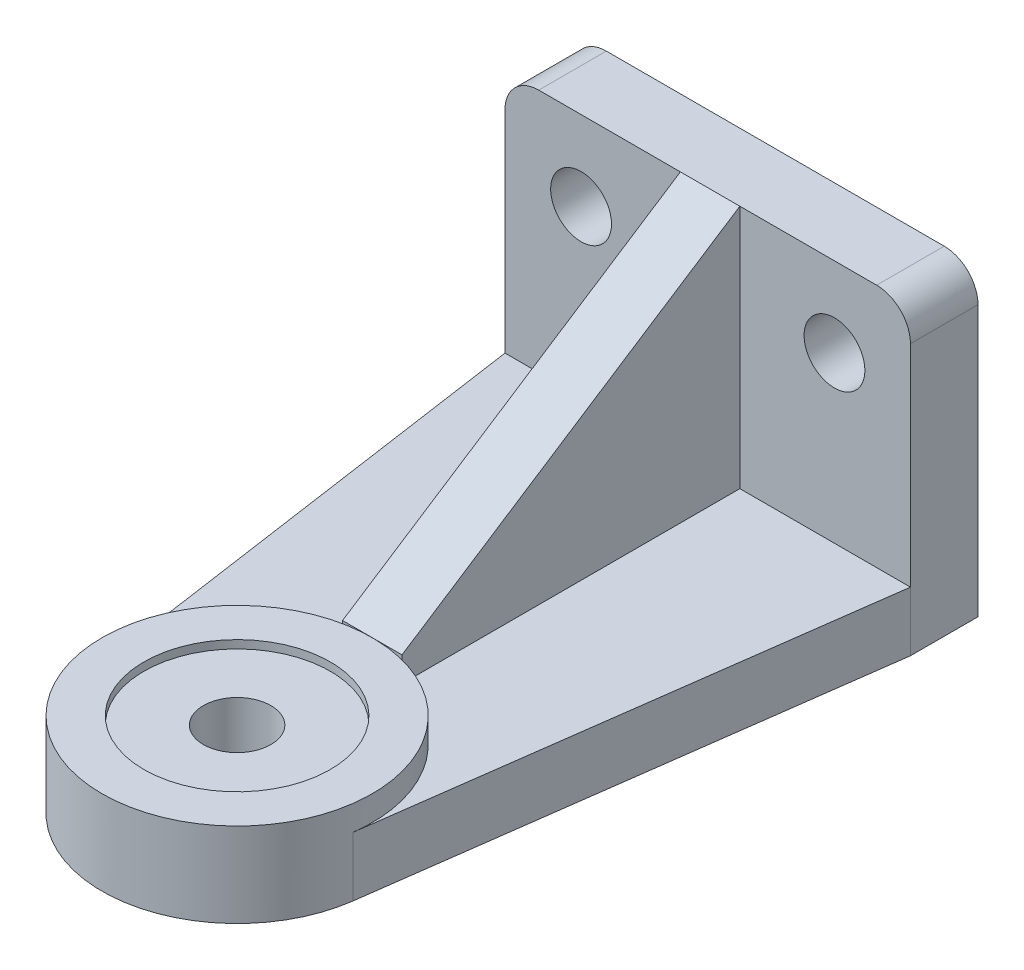
ISO-10303-21;
HEADER;
FILE_DESCRIPTION(('STEP AP214'),'2;1');
FILE_NAME('part.step','',(''),(''),'','','');
FILE_SCHEMA(('AUTOMOTIVE_DESIGN { 1 0 10303 214 1 1 1 1 }'));
ENDSEC;
DATA;
#1=APPLICATION_CONTEXT('core data for automotive mechanical design processes');
#2=APPLICATION_PROTOCOL_DEFINITION('international standard','automotive_design',2000,#1);
#3=PRODUCT_CONTEXT('',#1,'mechanical');
#4=PRODUCT('Part','Part','',(#3));
#5=PRODUCT_RELATED_PRODUCT_CATEGORY('part','',(#4));
#6=PRODUCT_DEFINITION_FORMATION('','',#4);
#7=PRODUCT_DEFINITION_CONTEXT('part definition',#1,'design');
#8=PRODUCT_DEFINITION('design','',#6,#7);
#9=PRODUCT_DEFINITION_SHAPE('','',#8);
#10=(LENGTH_UNIT() NAMED_UNIT(*) SI_UNIT(.MILLI.,.METRE.));
#11=(NAMED_UNIT(*) PLANE_ANGLE_UNIT() SI_UNIT($,.RADIAN.));
#12=(NAMED_UNIT(*) SI_UNIT($,.STERADIAN.) SOLID_ANGLE_UNIT());
#13=UNCERTAINTY_MEASURE_WITH_UNIT(LENGTH_MEASURE(1.E-05),#10,'distance_accuracy_value','');
#14=(GEOMETRIC_REPRESENTATION_CONTEXT(3) GLOBAL_UNCERTAINTY_ASSIGNED_CONTEXT((#13)) GLOBAL_UNIT_ASSIGNED_CONTEXT((#10,
#11,#12)) REPRESENTATION_CONTEXT('',''));
#15=CARTESIAN_POINT('',(0.,0.,0.));
#16=DIRECTION('',(0.,0.,1.));
#17=DIRECTION('',(1.,0.,0.));
#18=AXIS2_PLACEMENT_3D('',#15,#16,#17);
#19=CARTESIAN_POINT('',(5.588,11.176,-88.9));
#20=DIRECTION('',(0.,0.,1.));
#21=DIRECTION('',(1.,0.,0.));
#22=AXIS2_PLACEMENT_3D('',#19,#20,#21);
#23=PLANE('',#22);
#24=DIRECTION('',(0.,1.,0.));
#25=VECTOR('',#24,1.);
#26=CARTESIAN_POINT('',(-5.588,11.176,-88.9));
#27=LINE('',#26,#25);
#28=CARTESIAN_POINT('',(-5.588,11.176,-88.9));
#29=VERTEX_POINT('',#28);
#30=CARTESIAN_POINT('',(-5.588,57.15,-88.9));
#31=VERTEX_POINT('',#30);
#32=EDGE_CURVE('E117',#29,#31,#27,.T.);
#33=ORIENTED_EDGE('',*,*,#32,.T.);
#34=DIRECTION('',(-1.,0.,0.));
#35=VECTOR('',#34,1.);
#36=CARTESIAN_POINT('',(5.588,57.15,-88.9));
#37=LINE('',#36,#35);
#38=CARTESIAN_POINT('',(5.588,57.15,-88.9));
#39=VERTEX_POINT('',#38);
#40=EDGE_CURVE('E12',#39,#31,#37,.T.);
#41=ORIENTED_EDGE('',*,*,#40,.F.);
#42=DIRECTION('',(0.,1.,0.));
#43=VECTOR('',#42,1.);
#44=CARTESIAN_POINT('',(5.588,11.176,-88.9));
#45=LINE('',#44,#43);
#46=CARTESIAN_POINT('',(5.588,11.176,-88.9));
#47=VERTEX_POINT('',#46);
#48=EDGE_CURVE('E100',#47,#39,#45,.T.);
#49=ORIENTED_EDGE('',*,*,#48,.F.);
#50=DIRECTION('',(-1.,0.,0.));
#51=VECTOR('',#50,1.);
#52=CARTESIAN_POINT('',(5.588,11.176,-88.9));
#53=LINE('',#52,#51);
#54=EDGE_CURVE('E113',#47,#29,#53,.T.);
#55=ORIENTED_EDGE('',*,*,#54,.T.);
#56=EDGE_LOOP('',(#33,#41,#49,#55));
#57=FACE_BOUND('',#56,.T.);
#58=ADVANCED_FACE('F48',(#57),#23,.F.);
#59=CARTESIAN_POINT('',(5.588,57.15,-88.9));
#60=DIRECTION('',(0.,-0.838443616300637,-0.544988350595414));
#61=DIRECTION('',(0.,0.544988350595414,-0.838443616300637));
#62=AXIS2_PLACEMENT_3D('',#59,#60,#61);
#63=PLANE('',#62);
#64=DIRECTION('',(0.,-0.544988350595414,0.838443616300637));
#65=VECTOR('',#64,1.);
#66=CARTESIAN_POINT('',(-5.588,57.15,-88.9));
#67=LINE('',#66,#65);
#68=CARTESIAN_POINT('',(-5.588,15.875,-25.4));
#69=VERTEX_POINT('',#68);
#70=EDGE_CURVE('E105',#31,#69,#67,.T.);
#71=ORIENTED_EDGE('',*,*,#70,.T.);
#72=DIRECTION('',(-1.,0.,0.));
#73=VECTOR('',#72,1.);
#74=CARTESIAN_POINT('',(5.588,15.875,-25.4));
#75=LINE('',#74,#73);
#76=CARTESIAN_POINT('',(5.588,15.875,-25.4));
#77=VERTEX_POINT('',#76);
#78=EDGE_CURVE('E57',#77,#69,#75,.T.);
#79=ORIENTED_EDGE('',*,*,#78,.F.);
#80=DIRECTION('',(0.,-0.544988350595414,0.838443616300637));
#81=VECTOR('',#80,1.);
#82=CARTESIAN_POINT('',(5.588,57.15,-88.9));
#83=LINE('',#82,#81);
#84=EDGE_CURVE('E95',#39,#77,#83,.T.);
#85=ORIENTED_EDGE('',*,*,#84,.F.);
#86=ORIENTED_EDGE('',*,*,#40,.T.);
#87=EDGE_LOOP('',(#71,#79,#85,#86));
#88=FACE_BOUND('',#87,.T.);
#89=ADVANCED_FACE('F104',(#88),#63,.F.);
#90=CARTESIAN_POINT('',(5.588,15.875,-25.4));
#91=DIRECTION('',(0.,0.,-1.));
#92=DIRECTION('',(-1.,0.,0.));
#93=AXIS2_PLACEMENT_3D('',#90,#91,#92);
#94=PLANE('',#93);
#95=DIRECTION('',(0.,-1.,0.));
#96=VECTOR('',#95,1.);
#97=CARTESIAN_POINT('',(-5.588,15.875,-25.4));
#98=LINE('',#97,#96);
#99=CARTESIAN_POINT('',(-5.588,11.176,-25.4));
#100=VERTEX_POINT('',#99);
#101=EDGE_CURVE('E82',#69,#100,#98,.T.);
#102=ORIENTED_EDGE('',*,*,#101,.T.);
#103=DIRECTION('',(-1.,0.,0.));
#104=VECTOR('',#103,1.);
#105=CARTESIAN_POINT('',(5.588,11.176,-25.4));
#106=LINE('',#105,#104);
#107=CARTESIAN_POINT('',(5.588,11.176,-25.4));
#108=VERTEX_POINT('',#107);
#109=EDGE_CURVE('E107',#108,#100,#106,.T.);
#110=ORIENTED_EDGE('',*,*,#109,.F.);
#111=DIRECTION('',(0.,-1.,0.));
#112=VECTOR('',#111,1.);
#113=CARTESIAN_POINT('',(5.588,15.875,-25.4));
#114=LINE('',#113,#112);
#115=EDGE_CURVE('E98',#77,#108,#114,.T.);
#116=ORIENTED_EDGE('',*,*,#115,.F.);
#117=ORIENTED_EDGE('',*,*,#78,.T.);
#118=EDGE_LOOP('',(#102,#110,#116,#117));
#119=FACE_BOUND('',#118,.T.);
#120=ADVANCED_FACE('F108',(#119),#94,.F.);
#121=CARTESIAN_POINT('',(5.588,11.176,-25.4));
#122=DIRECTION('',(0.,1.,0.));
#123=DIRECTION('',(0.,0.,1.));
#124=AXIS2_PLACEMENT_3D('',#121,#122,#123);
#125=PLANE('',#124);
#126=DIRECTION('',(0.,0.,-1.));
#127=VECTOR('',#126,1.);
#128=CARTESIAN_POINT('',(-5.588,11.176,-25.4));
#129=LINE('',#128,#127);
#130=EDGE_CURVE('E88',#100,#29,#129,.T.);
#131=ORIENTED_EDGE('',*,*,#130,.T.);
#132=ORIENTED_EDGE('',*,*,#54,.F.);
#133=DIRECTION('',(0.,0.,-1.));
#134=VECTOR('',#133,1.);
#135=CARTESIAN_POINT('',(5.588,11.176,-25.4));
#136=LINE('',#135,#134);
#137=EDGE_CURVE('E65',#108,#47,#136,.T.);
#138=ORIENTED_EDGE('',*,*,#137,.F.);
#139=ORIENTED_EDGE('',*,*,#109,.T.);
#140=EDGE_LOOP('',(#131,#132,#138,#139));
#141=FACE_BOUND('',#140,.T.);
#142=ADVANCED_FACE('F131',(#141),#125,.F.);
#143=CARTESIAN_POINT('',(5.588,0.,0.));
#144=DIRECTION('',(-1.,0.,0.));
#145=DIRECTION('',(0.,0.,1.));
#146=AXIS2_PLACEMENT_3D('',#143,#144,#145);
#147=PLANE('',#146);
#148=ORIENTED_EDGE('',*,*,#48,.T.);
#149=ORIENTED_EDGE('',*,*,#84,.T.);
#150=ORIENTED_EDGE('',*,*,#115,.T.);
#151=ORIENTED_EDGE('',*,*,#137,.T.);
#152=EDGE_LOOP('',(#148,#149,#150,#151));
#153=FACE_BOUND('',#152,.T.);
#154=ADVANCED_FACE('F96',(#153),#147,.F.);
#155=CARTESIAN_POINT('',(-5.588,0.,0.));
#156=DIRECTION('',(-1.,0.,0.));
#157=DIRECTION('',(0.,0.,1.));
#158=AXIS2_PLACEMENT_3D('',#155,#156,#157);
#159=PLANE('',#158);
#160=ORIENTED_EDGE('',*,*,#32,.F.);
#161=ORIENTED_EDGE('',*,*,#130,.F.);
#162=ORIENTED_EDGE('',*,*,#101,.F.);
#163=ORIENTED_EDGE('',*,*,#70,.F.);
#164=EDGE_LOOP('',(#160,#161,#162,#163));
#165=FACE_BOUND('',#164,.T.);
#166=ADVANCED_FACE('F134',(#165),#159,.T.);
#167=CLOSED_SHELL('',(#58,#89,#120,#142,#154,#166));
#168=MANIFOLD_SOLID_BREP('B2',#167);
#169=CARTESIAN_POINT('',(37.6477006881978,15.875,-88.9));
#170=DIRECTION('',(-0.990987706001351,0.,-0.133952851982256));
#171=DIRECTION('',(-0.133952851982256,0.,0.990987706001351));
#172=AXIS2_PLACEMENT_3D('',#169,#170,#171);
#173=PLANE('',#172);
#174=DIRECTION('',(0.133952851982256,0.,-0.990987706001351));
#175=VECTOR('',#174,1.);
#176=CARTESIAN_POINT('',(37.6477006881978,11.176,-88.9));
#177=LINE('',#176,#175);
#178=CARTESIAN_POINT('',(25.1710877324343,11.176,3.40240244034931));
#179=VERTEX_POINT('',#178);
#180=CARTESIAN_POINT('',(37.6477006881978,11.176,-88.9));
#181=VERTEX_POINT('',#180);
#182=EDGE_CURVE('E323',#179,#181,#177,.T.);
#183=ORIENTED_EDGE('',*,*,#182,.F.);
#184=DIRECTION('',(0.,-1.,0.));
#185=VECTOR('',#184,1.);
#186=CARTESIAN_POINT('',(25.1710877324343,15.875,3.40240244034931));
#187=LINE('',#186,#185);
#188=CARTESIAN_POINT('',(25.1710877324343,0.,3.40240244034931));
#189=VERTEX_POINT('',#188);
#190=EDGE_CURVE('E355',#179,#189,#187,.T.);
#191=ORIENTED_EDGE('',*,*,#190,.T.);
#192=DIRECTION('',(0.133952851982256,0.,-0.990987706001351));
#193=VECTOR('',#192,1.);
#194=CARTESIAN_POINT('',(37.6477006881978,0.,-88.9));
#195=LINE('',#194,#193);
#196=CARTESIAN_POINT('',(37.6477006881978,0.,-88.9));
#197=VERTEX_POINT('',#196);
#198=EDGE_CURVE('E341',#189,#197,#195,.T.);
#199=ORIENTED_EDGE('',*,*,#198,.T.);
#200=DIRECTION('',(0.,-1.,0.));
#201=VECTOR('',#200,1.);
#202=CARTESIAN_POINT('',(37.6477006881978,15.875,-88.9));
#203=LINE('',#202,#201);
#204=EDGE_CURVE('E307',#181,#197,#203,.T.);
#205=ORIENTED_EDGE('',*,*,#204,.F.);
#206=EDGE_LOOP('',(#183,#191,#199,#205));
#207=FACE_BOUND('',#206,.T.);
#208=ADVANCED_FACE('F207',(#207),#173,.F.);
#209=CARTESIAN_POINT('',(-25.137268282347,15.875,3.64386378742537));
#210=DIRECTION('',(0.989656231588466,0.,-0.143459204229346));
#211=DIRECTION('',(-0.143459204229346,0.,-0.989656231588466));
#212=AXIS2_PLACEMENT_3D('',#209,#210,#211);
#213=PLANE('',#212);
#214=DIRECTION('',(0.143459204229346,0.,0.989656231588466));
#215=VECTOR('',#214,1.);
#216=CARTESIAN_POINT('',(-25.137268282347,11.176,3.64386378742537));
#217=LINE('',#216,#215);
#218=CARTESIAN_POINT('',(-38.5522993118022,11.176,-88.9));
#219=VERTEX_POINT('',#218);
#220=CARTESIAN_POINT('',(-25.137268282347,11.176,3.64386378742535));
#221=VERTEX_POINT('',#220);
#222=EDGE_CURVE('E309',#219,#221,#217,.T.);
#223=ORIENTED_EDGE('',*,*,#222,.F.);
#224=DIRECTION('',(0.,-1.,0.));
#225=VECTOR('',#224,1.);
#226=CARTESIAN_POINT('',(-38.5522993118022,15.875,-88.9));
#227=LINE('',#226,#225);
#228=CARTESIAN_POINT('',(-38.5522993118023,0.,-88.9));
#229=VERTEX_POINT('',#228);
#230=EDGE_CURVE('E349',#219,#229,#227,.T.);
#231=ORIENTED_EDGE('',*,*,#230,.T.);
#232=DIRECTION('',(0.143459204229346,0.,0.989656231588466));
#233=VECTOR('',#232,1.);
#234=CARTESIAN_POINT('',(-25.137268282347,0.,3.64386378742537));
#235=LINE('',#234,#233);
#236=CARTESIAN_POINT('',(-25.137268282347,0.,3.64386378742537));
#237=VERTEX_POINT('',#236);
#238=EDGE_CURVE('E337',#229,#237,#235,.T.);
#239=ORIENTED_EDGE('',*,*,#238,.T.);
#240=DIRECTION('',(0.,-1.,0.));
#241=VECTOR('',#240,1.);
#242=CARTESIAN_POINT('',(-25.137268282347,15.875,3.64386378742537));
#243=LINE('',#242,#241);
#244=EDGE_CURVE('E336',#221,#237,#243,.T.);
#245=ORIENTED_EDGE('',*,*,#244,.F.);
#246=EDGE_LOOP('',(#223,#231,#239,#245));
#247=FACE_BOUND('',#246,.T.);
#248=ADVANCED_FACE('F479',(#247),#213,.F.);
#249=CARTESIAN_POINT('',(0.,15.875,0.));
#250=DIRECTION('',(0.,1.,0.));
#251=DIRECTION('',(0.,0.,1.));
#252=AXIS2_PLACEMENT_3D('',#249,#250,#251);
#253=PLANE('',#252);
#254=CARTESIAN_POINT('',(0.,15.875,0.));
#255=DIRECTION('',(0.,1.,0.));
#256=DIRECTION('',(0.,0.,1.));
#257=AXIS2_PLACEMENT_3D('',#254,#255,#256);
#258=CIRCLE('',#257,17.526);
#259=CARTESIAN_POINT('',(0.,15.875,17.526));
#260=VERTEX_POINT('',#259);
#261=EDGE_CURVE('E432',#260,#260,#258,.T.);
#262=ORIENTED_EDGE('',*,*,#261,.F.);
#263=EDGE_LOOP('',(#262));
#264=FACE_BOUND('',#263,.T.);
#265=CARTESIAN_POINT('',(0.,15.875,0.));
#266=DIRECTION('',(0.,1.,0.));
#267=DIRECTION('',(0.,0.,1.));
#268=AXIS2_PLACEMENT_3D('',#265,#266,#267);
#269=CIRCLE('',#268,25.4);
#270=CARTESIAN_POINT('',(0.,15.875,25.4));
#271=VERTEX_POINT('',#270);
#272=EDGE_CURVE('E332',#271,#271,#269,.T.);
#273=ORIENTED_EDGE('',*,*,#272,.T.);
#274=EDGE_LOOP('',(#273));
#275=FACE_BOUND('',#274,.T.);
#276=ADVANCED_FACE('F485',(#264,#275),#253,.T.);
#277=CARTESIAN_POINT('',(0.,15.875,0.));
#278=DIRECTION('',(0.,-1.,0.));
#279=DIRECTION('',(0.,0.,-1.));
#280=AXIS2_PLACEMENT_3D('',#277,#278,#279);
#281=CYLINDRICAL_SURFACE('',#280,25.4);
#282=ORIENTED_EDGE('',*,*,#190,.F.);
#283=CARTESIAN_POINT('',(0.,11.176,0.));
#284=DIRECTION('',(0.,-1.,0.));
#285=DIRECTION('',(0.,0.,1.));
#286=AXIS2_PLACEMENT_3D('',#283,#284,#285);
#287=CIRCLE('',#286,25.4);
#288=EDGE_CURVE('E315',#221,#179,#287,.T.);
#289=ORIENTED_EDGE('',*,*,#288,.F.);
#290=ORIENTED_EDGE('',*,*,#244,.T.);
#291=CARTESIAN_POINT('',(0.,0.,0.));
#292=DIRECTION('',(0.,1.,0.));
#293=DIRECTION('',(0.,0.,1.));
#294=AXIS2_PLACEMENT_3D('',#291,#292,#293);
#295=CIRCLE('',#294,25.4);
#296=EDGE_CURVE('E331',#237,#189,#295,.T.);
#297=ORIENTED_EDGE('',*,*,#296,.T.);
#298=EDGE_LOOP('',(#282,#289,#290,#297));
#299=FACE_BOUND('',#298,.T.);
#300=ORIENTED_EDGE('',*,*,#272,.F.);
#301=EDGE_LOOP('',(#300));
#302=FACE_BOUND('',#301,.T.);
#303=ADVANCED_FACE('F491',(#299,#302),#281,.T.);
#304=CARTESIAN_POINT('',(0.,0.,0.));
#305=DIRECTION('',(0.,1.,0.));
#306=DIRECTION('',(0.,0.,1.));
#307=AXIS2_PLACEMENT_3D('',#304,#305,#306);
#308=PLANE('',#307);
#309=CARTESIAN_POINT('',(0.,0.,0.));
#310=DIRECTION('',(0.,1.,0.));
#311=DIRECTION('',(0.,0.,1.));
#312=AXIS2_PLACEMENT_3D('',#309,#310,#311);
#313=CIRCLE('',#312,6.35);
#314=CARTESIAN_POINT('',(0.,0.,6.35));
#315=VERTEX_POINT('',#314);
#316=EDGE_CURVE('E416',#315,#315,#313,.T.);
#317=ORIENTED_EDGE('',*,*,#316,.T.);
#318=EDGE_LOOP('',(#317));
#319=FACE_BOUND('',#318,.T.);
#320=ORIENTED_EDGE('',*,*,#296,.F.);
#321=ORIENTED_EDGE('',*,*,#238,.F.);
#322=DIRECTION('',(0.,0.,1.));
#323=VECTOR('',#322,1.);
#324=CARTESIAN_POINT('',(-38.5522993118023,0.,-101.6));
#325=LINE('',#324,#323);
#326=CARTESIAN_POINT('',(-38.5522993118023,0.,-101.6));
#327=VERTEX_POINT('',#326);
#328=EDGE_CURVE('E301',#327,#229,#325,.T.);
#329=ORIENTED_EDGE('',*,*,#328,.F.);
#330=DIRECTION('',(-1.,0.,0.));
#331=VECTOR('',#330,1.);
#332=CARTESIAN_POINT('',(37.6477006881978,0.,-101.6));
#333=LINE('',#332,#331);
#334=CARTESIAN_POINT('',(37.6477006881978,0.,-101.6));
#335=VERTEX_POINT('',#334);
#336=EDGE_CURVE('E283',#335,#327,#333,.T.);
#337=ORIENTED_EDGE('',*,*,#336,.F.);
#338=DIRECTION('',(0.,0.,1.));
#339=VECTOR('',#338,1.);
#340=CARTESIAN_POINT('',(37.6477006881978,0.,-101.6));
#341=LINE('',#340,#339);
#342=EDGE_CURVE('E298',#335,#197,#341,.T.);
#343=ORIENTED_EDGE('',*,*,#342,.T.);
#344=ORIENTED_EDGE('',*,*,#198,.F.);
#345=EDGE_LOOP('',(#320,#321,#329,#337,#343,#344));
#346=FACE_BOUND('',#345,.T.);
#347=ADVANCED_FACE('F296',(#319,#346),#308,.F.);
#348=CARTESIAN_POINT('',(0.,11.176,0.));
#349=DIRECTION('',(0.,1.,0.));
#350=DIRECTION('',(0.,0.,1.));
#351=AXIS2_PLACEMENT_3D('',#348,#349,#350);
#352=PLANE('',#351);
#353=ORIENTED_EDGE('',*,*,#222,.T.);
#354=ORIENTED_EDGE('',*,*,#288,.T.);
#355=ORIENTED_EDGE('',*,*,#182,.T.);
#356=DIRECTION('',(-1.,0.,0.));
#357=VECTOR('',#356,1.);
#358=CARTESIAN_POINT('',(-38.5522993118022,11.176,-88.9));
#359=LINE('',#358,#357);
#360=EDGE_CURVE('E327',#181,#219,#359,.T.);
#361=ORIENTED_EDGE('',*,*,#360,.T.);
#362=EDGE_LOOP('',(#353,#354,#355,#361));
#363=FACE_BOUND('',#362,.T.);
#364=ADVANCED_FACE('F458',(#363),#352,.T.);
#365=CARTESIAN_POINT('',(0.,0.,-88.9));
#366=DIRECTION('',(0.,0.,1.));
#367=DIRECTION('',(1.,0.,0.));
#368=AXIS2_PLACEMENT_3D('',#365,#366,#367);
#369=PLANE('',#368);
#370=CARTESIAN_POINT('',(-24.2520993118022,42.164,-88.9));
#371=DIRECTION('',(0.,0.,1.));
#372=DIRECTION('',(1.,0.,0.));
#373=AXIS2_PLACEMENT_3D('',#370,#371,#372);
#374=CIRCLE('',#373,5.715);
#375=CARTESIAN_POINT('',(-18.5370993118022,42.164,-88.9));
#376=VERTEX_POINT('',#375);
#377=EDGE_CURVE('E448',#376,#376,#374,.T.);
#378=ORIENTED_EDGE('',*,*,#377,.F.);
#379=EDGE_LOOP('',(#378));
#380=FACE_BOUND('',#379,.T.);
#381=CARTESIAN_POINT('',(23.3729006881978,42.164,-88.9));
#382=DIRECTION('',(0.,0.,1.));
#383=DIRECTION('',(1.,0.,0.));
#384=AXIS2_PLACEMENT_3D('',#381,#382,#383);
#385=CIRCLE('',#384,5.715);
#386=CARTESIAN_POINT('',(29.0879006881978,42.164,-88.9));
#387=VERTEX_POINT('',#386);
#388=EDGE_CURVE('E440',#387,#387,#385,.T.);
#389=ORIENTED_EDGE('',*,*,#388,.F.);
#390=EDGE_LOOP('',(#389));
#391=FACE_BOUND('',#390,.T.);
#392=DIRECTION('',(0.,-1.,0.));
#393=VECTOR('',#392,1.);
#394=CARTESIAN_POINT('',(37.6477006881978,0.,-88.9));
#395=LINE('',#394,#393);
#396=CARTESIAN_POINT('',(37.6477006881978,50.8,-88.9));
#397=VERTEX_POINT('',#396);
#398=EDGE_CURVE('E411',#397,#181,#395,.T.);
#399=ORIENTED_EDGE('',*,*,#398,.F.);
#400=CARTESIAN_POINT('',(31.2977006881978,50.8,-88.9));
#401=DIRECTION('',(0.,0.,1.));
#402=DIRECTION('',(1.,0.,0.));
#403=AXIS2_PLACEMENT_3D('',#400,#401,#402);
#404=CIRCLE('',#403,6.35);
#405=CARTESIAN_POINT('',(31.2977006881978,57.15,-88.9));
#406=VERTEX_POINT('',#405);
#407=EDGE_CURVE('E364',#397,#406,#404,.T.);
#408=ORIENTED_EDGE('',*,*,#407,.T.);
#409=DIRECTION('',(1.,0.,0.));
#410=VECTOR('',#409,1.);
#411=CARTESIAN_POINT('',(37.6477006881978,57.15,-88.9));
#412=LINE('',#411,#410);
#413=CARTESIAN_POINT('',(-32.2022993118022,57.15,-88.9));
#414=VERTEX_POINT('',#413);
#415=EDGE_CURVE('E291',#414,#406,#412,.T.);
#416=ORIENTED_EDGE('',*,*,#415,.F.);
#417=CARTESIAN_POINT('',(-32.2022993118022,50.8,-88.9));
#418=DIRECTION('',(0.,0.,1.));
#419=DIRECTION('',(1.,0.,0.));
#420=AXIS2_PLACEMENT_3D('',#417,#418,#419);
#421=CIRCLE('',#420,6.35);
#422=CARTESIAN_POINT('',(-38.5522993118023,50.8,-88.9));
#423=VERTEX_POINT('',#422);
#424=EDGE_CURVE('E361',#414,#423,#421,.T.);
#425=ORIENTED_EDGE('',*,*,#424,.T.);
#426=DIRECTION('',(0.,1.,0.));
#427=VECTOR('',#426,1.);
#428=CARTESIAN_POINT('',(-38.5522993118023,0.,-88.9));
#429=LINE('',#428,#427);
#430=EDGE_CURVE('E408',#219,#423,#429,.T.);
#431=ORIENTED_EDGE('',*,*,#430,.F.);
#432=ORIENTED_EDGE('',*,*,#360,.F.);
#433=EDGE_LOOP('',(#399,#408,#416,#425,#431,#432));
#434=FACE_BOUND('',#433,.T.);
#435=ADVANCED_FACE('F406',(#380,#391,#434),#369,.T.);
#436=CARTESIAN_POINT('',(37.6477006881978,0.,-101.6));
#437=DIRECTION('',(-1.,0.,0.));
#438=DIRECTION('',(0.,0.,1.));
#439=AXIS2_PLACEMENT_3D('',#436,#437,#438);
#440=PLANE('',#439);
#441=DIRECTION('',(0.,-1.,0.));
#442=VECTOR('',#441,1.);
#443=CARTESIAN_POINT('',(37.6477006881978,0.,-101.6));
#444=LINE('',#443,#442);
#445=CARTESIAN_POINT('',(37.6477006881978,50.8,-101.6));
#446=VERTEX_POINT('',#445);
#447=EDGE_CURVE('E280',#446,#335,#444,.T.);
#448=ORIENTED_EDGE('',*,*,#447,.F.);
#449=DIRECTION('',(0.,0.,1.));
#450=VECTOR('',#449,1.);
#451=CARTESIAN_POINT('',(37.6477006881978,50.8,-101.6));
#452=LINE('',#451,#450);
#453=EDGE_CURVE('E358',#446,#397,#452,.T.);
#454=ORIENTED_EDGE('',*,*,#453,.T.);
#455=ORIENTED_EDGE('',*,*,#398,.T.);
#456=ORIENTED_EDGE('',*,*,#204,.T.);
#457=ORIENTED_EDGE('',*,*,#342,.F.);
#458=EDGE_LOOP('',(#448,#454,#455,#456,#457));
#459=FACE_BOUND('',#458,.T.);
#460=ADVANCED_FACE('F305',(#459),#440,.F.);
#461=CARTESIAN_POINT('',(-38.5522993118023,0.,-101.6));
#462=DIRECTION('',(1.,0.,0.));
#463=DIRECTION('',(0.,0.,-1.));
#464=AXIS2_PLACEMENT_3D('',#461,#462,#463);
#465=PLANE('',#464);
#466=ORIENTED_EDGE('',*,*,#430,.T.);
#467=DIRECTION('',(0.,0.,1.));
#468=VECTOR('',#467,1.);
#469=CARTESIAN_POINT('',(-38.5522993118023,50.8,-101.6));
#470=LINE('',#469,#468);
#471=CARTESIAN_POINT('',(-38.5522993118023,50.8,-101.6));
#472=VERTEX_POINT('',#471);
#473=EDGE_CURVE('E46',#423,#472,#470,.F.);
#474=ORIENTED_EDGE('',*,*,#473,.T.);
#475=DIRECTION('',(0.,1.,0.));
#476=VECTOR('',#475,1.);
#477=CARTESIAN_POINT('',(-38.5522993118023,0.,-101.6));
#478=LINE('',#477,#476);
#479=EDGE_CURVE('E303',#327,#472,#478,.T.);
#480=ORIENTED_EDGE('',*,*,#479,.F.);
#481=ORIENTED_EDGE('',*,*,#328,.T.);
#482=ORIENTED_EDGE('',*,*,#230,.F.);
#483=EDGE_LOOP('',(#466,#474,#480,#481,#482));
#484=FACE_BOUND('',#483,.T.);
#485=ADVANCED_FACE('F409',(#484),#465,.F.);
#486=CARTESIAN_POINT('',(37.6477006881978,57.15,-101.6));
#487=DIRECTION('',(0.,-1.,0.));
#488=DIRECTION('',(0.,0.,-1.));
#489=AXIS2_PLACEMENT_3D('',#486,#487,#488);
#490=PLANE('',#489);
#491=ORIENTED_EDGE('',*,*,#415,.T.);
#492=DIRECTION('',(0.,0.,1.));
#493=VECTOR('',#492,1.);
#494=CARTESIAN_POINT('',(31.2977006881978,57.15,-101.6));
#495=LINE('',#494,#493);
#496=CARTESIAN_POINT('',(31.2977006881978,57.15,-101.6));
#497=VERTEX_POINT('',#496);
#498=EDGE_CURVE('E229',#406,#497,#495,.F.);
#499=ORIENTED_EDGE('',*,*,#498,.T.);
#500=DIRECTION('',(1.,0.,0.));
#501=VECTOR('',#500,1.);
#502=CARTESIAN_POINT('',(37.6477006881978,57.15,-101.6));
#503=LINE('',#502,#501);
#504=CARTESIAN_POINT('',(-32.2022993118022,57.15,-101.6));
#505=VERTEX_POINT('',#504);
#506=EDGE_CURVE('E317',#505,#497,#503,.T.);
#507=ORIENTED_EDGE('',*,*,#506,.F.);
#508=DIRECTION('',(0.,0.,1.));
#509=VECTOR('',#508,1.);
#510=CARTESIAN_POINT('',(-32.2022993118022,57.15,-101.6));
#511=LINE('',#510,#509);
#512=EDGE_CURVE('E367',#505,#414,#511,.T.);
#513=ORIENTED_EDGE('',*,*,#512,.T.);
#514=EDGE_LOOP('',(#491,#499,#507,#513));
#515=FACE_BOUND('',#514,.T.);
#516=ADVANCED_FACE('F399',(#515),#490,.F.);
#517=CARTESIAN_POINT('',(0.,0.,-101.6));
#518=DIRECTION('',(0.,0.,1.));
#519=DIRECTION('',(1.,0.,0.));
#520=AXIS2_PLACEMENT_3D('',#517,#518,#519);
#521=PLANE('',#520);
#522=CARTESIAN_POINT('',(-24.2520993118022,42.164,-101.6));
#523=DIRECTION('',(0.,0.,1.));
#524=DIRECTION('',(1.,0.,0.));
#525=AXIS2_PLACEMENT_3D('',#522,#523,#524);
#526=CIRCLE('',#525,5.715);
#527=CARTESIAN_POINT('',(-18.5370993118022,42.164,-101.6));
#528=VERTEX_POINT('',#527);
#529=EDGE_CURVE('E444',#528,#528,#526,.T.);
#530=ORIENTED_EDGE('',*,*,#529,.T.);
#531=EDGE_LOOP('',(#530));
#532=FACE_BOUND('',#531,.T.);
#533=CARTESIAN_POINT('',(23.3729006881978,42.164,-101.6));
#534=DIRECTION('',(0.,0.,1.));
#535=DIRECTION('',(1.,0.,0.));
#536=AXIS2_PLACEMENT_3D('',#533,#534,#535);
#537=CIRCLE('',#536,5.715);
#538=CARTESIAN_POINT('',(29.0879006881978,42.164,-101.6));
#539=VERTEX_POINT('',#538);
#540=EDGE_CURVE('E436',#539,#539,#537,.T.);
#541=ORIENTED_EDGE('',*,*,#540,.T.);
#542=EDGE_LOOP('',(#541));
#543=FACE_BOUND('',#542,.T.);
#544=ORIENTED_EDGE('',*,*,#506,.T.);
#545=CARTESIAN_POINT('',(31.2977006881978,50.8,-101.6));
#546=DIRECTION('',(0.,0.,1.));
#547=DIRECTION('',(1.,0.,0.));
#548=AXIS2_PLACEMENT_3D('',#545,#546,#547);
#549=CIRCLE('',#548,6.35);
#550=EDGE_CURVE('E216',#497,#446,#549,.F.);
#551=ORIENTED_EDGE('',*,*,#550,.T.);
#552=ORIENTED_EDGE('',*,*,#447,.T.);
#553=ORIENTED_EDGE('',*,*,#336,.T.);
#554=ORIENTED_EDGE('',*,*,#479,.T.);
#555=CARTESIAN_POINT('',(-32.2022993118022,50.8,-101.6));
#556=DIRECTION('',(0.,0.,1.));
#557=DIRECTION('',(1.,0.,0.));
#558=AXIS2_PLACEMENT_3D('',#555,#556,#557);
#559=CIRCLE('',#558,6.35);
#560=EDGE_CURVE('E373',#472,#505,#559,.F.);
#561=ORIENTED_EDGE('',*,*,#560,.T.);
#562=EDGE_LOOP('',(#544,#551,#552,#553,#554,#561));
#563=FACE_BOUND('',#562,.T.);
#564=ADVANCED_FACE('F282',(#532,#543,#563),#521,.F.);
#565=CARTESIAN_POINT('',(0.,15.875,0.));
#566=DIRECTION('',(0.,1.,0.));
#567=DIRECTION('',(0.,0.,1.));
#568=AXIS2_PLACEMENT_3D('',#565,#566,#567);
#569=CYLINDRICAL_SURFACE('',#568,6.35);
#570=ORIENTED_EDGE('',*,*,#316,.F.);
#571=EDGE_LOOP('',(#570));
#572=FACE_BOUND('',#571,.T.);
#573=CARTESIAN_POINT('',(0.,14.351,0.));
#574=DIRECTION('',(0.,1.,0.));
#575=DIRECTION('',(0.,0.,1.));
#576=AXIS2_PLACEMENT_3D('',#573,#574,#575);
#577=CIRCLE('',#576,6.35);
#578=CARTESIAN_POINT('',(0.,14.351,6.35));
#579=VERTEX_POINT('',#578);
#580=EDGE_CURVE('E424',#579,#579,#577,.T.);
#581=ORIENTED_EDGE('',*,*,#580,.T.);
#582=EDGE_LOOP('',(#581));
#583=FACE_BOUND('',#582,.T.);
#584=ADVANCED_FACE('F521',(#572,#583),#569,.F.);
#585=CARTESIAN_POINT('',(6.35,14.351,0.));
#586=DIRECTION('',(0.,-1.,0.));
#587=DIRECTION('',(0.,0.,-1.));
#588=AXIS2_PLACEMENT_3D('',#585,#586,#587);
#589=PLANE('',#588);
#590=ORIENTED_EDGE('',*,*,#580,.F.);
#591=EDGE_LOOP('',(#590));
#592=FACE_BOUND('',#591,.T.);
#593=CARTESIAN_POINT('',(0.,14.351,0.));
#594=DIRECTION('',(0.,1.,0.));
#595=DIRECTION('',(0.,0.,1.));
#596=AXIS2_PLACEMENT_3D('',#593,#594,#595);
#597=CIRCLE('',#596,17.526);
#598=CARTESIAN_POINT('',(0.,14.351,17.526));
#599=VERTEX_POINT('',#598);
#600=EDGE_CURVE('E428',#599,#599,#597,.T.);
#601=ORIENTED_EDGE('',*,*,#600,.T.);
#602=EDGE_LOOP('',(#601));
#603=FACE_BOUND('',#602,.T.);
#604=ADVANCED_FACE('F474',(#592,#603),#589,.F.);
#605=CARTESIAN_POINT('',(0.,15.875,0.));
#606=DIRECTION('',(0.,1.,0.));
#607=DIRECTION('',(0.,0.,1.));
#608=AXIS2_PLACEMENT_3D('',#605,#606,#607);
#609=CYLINDRICAL_SURFACE('',#608,17.526);
#610=ORIENTED_EDGE('',*,*,#600,.F.);
#611=EDGE_LOOP('',(#610));
#612=FACE_BOUND('',#611,.T.);
#613=ORIENTED_EDGE('',*,*,#261,.T.);
#614=EDGE_LOOP('',(#613));
#615=FACE_BOUND('',#614,.T.);
#616=ADVANCED_FACE('F464',(#612,#615),#609,.F.);
#617=CARTESIAN_POINT('',(23.3729006881978,42.164,-88.9));
#618=DIRECTION('',(0.,0.,1.));
#619=DIRECTION('',(1.,0.,0.));
#620=AXIS2_PLACEMENT_3D('',#617,#618,#619);
#621=CYLINDRICAL_SURFACE('',#620,5.715);
#622=ORIENTED_EDGE('',*,*,#540,.F.);
#623=EDGE_LOOP('',(#622));
#624=FACE_BOUND('',#623,.T.);
#625=ORIENTED_EDGE('',*,*,#388,.T.);
#626=EDGE_LOOP('',(#625));
#627=FACE_BOUND('',#626,.T.);
#628=ADVANCED_FACE('F462',(#624,#627),#621,.F.);
#629=CARTESIAN_POINT('',(-24.2520993118022,42.164,-88.9));
#630=DIRECTION('',(0.,0.,1.));
#631=DIRECTION('',(1.,0.,0.));
#632=AXIS2_PLACEMENT_3D('',#629,#630,#631);
#633=CYLINDRICAL_SURFACE('',#632,5.715);
#634=ORIENTED_EDGE('',*,*,#529,.F.);
#635=EDGE_LOOP('',(#634));
#636=FACE_BOUND('',#635,.T.);
#637=ORIENTED_EDGE('',*,*,#377,.T.);
#638=EDGE_LOOP('',(#637));
#639=FACE_BOUND('',#638,.T.);
#640=ADVANCED_FACE('F454',(#636,#639),#633,.F.);
#641=CARTESIAN_POINT('',(31.2977006881978,50.8,-101.6));
#642=DIRECTION('',(0.,0.,1.));
#643=DIRECTION('',(1.,0.,0.));
#644=AXIS2_PLACEMENT_3D('',#641,#642,#643);
#645=CYLINDRICAL_SURFACE('',#644,6.35);
#646=ORIENTED_EDGE('',*,*,#550,.F.);
#647=ORIENTED_EDGE('',*,*,#498,.F.);
#648=ORIENTED_EDGE('',*,*,#407,.F.);
#649=ORIENTED_EDGE('',*,*,#453,.F.);
#650=EDGE_LOOP('',(#646,#647,#648,#649));
#651=FACE_BOUND('',#650,.T.);
#652=ADVANCED_FACE('F471',(#651),#645,.T.);
#653=CARTESIAN_POINT('',(-32.2022993118022,50.8,-101.6));
#654=DIRECTION('',(0.,0.,1.));
#655=DIRECTION('',(1.,0.,0.));
#656=AXIS2_PLACEMENT_3D('',#653,#654,#655);
#657=CYLINDRICAL_SURFACE('',#656,6.35);
#658=ORIENTED_EDGE('',*,*,#560,.F.);
#659=ORIENTED_EDGE('',*,*,#473,.F.);
#660=ORIENTED_EDGE('',*,*,#424,.F.);
#661=ORIENTED_EDGE('',*,*,#512,.F.);
#662=EDGE_LOOP('',(#658,#659,#660,#661));
#663=FACE_BOUND('',#662,.T.);
#664=ADVANCED_FACE('F209',(#663),#657,.T.);
#665=CLOSED_SHELL('',(#208,#248,#276,#303,#347,#364,#435,#460,#485,#516,#564,#584,#604,#616,
#628,#640,#652,#664));
#666=MANIFOLD_SOLID_BREP('B6',#665);
#667=ADVANCED_BREP_SHAPE_REPRESENTATION('',(#18,#168,#666),#14);
#668=SHAPE_DEFINITION_REPRESENTATION(#9,#667);
ENDSEC;
END-ISO-10303-21;
